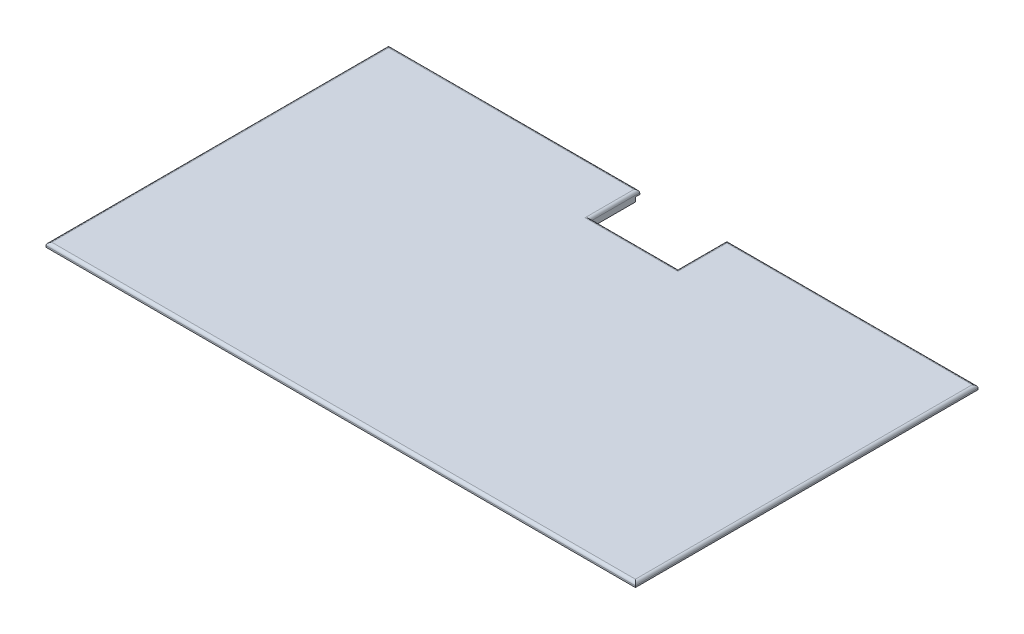
ISO-10303-21;
HEADER;
FILE_DESCRIPTION(('STEP AP214'),'2;1');
FILE_NAME('part.step','',(''),(''),'','','');
FILE_SCHEMA(('AUTOMOTIVE_DESIGN { 1 0 10303 214 1 1 1 1 }'));
ENDSEC;
DATA;
#1=APPLICATION_CONTEXT('core data for automotive mechanical design processes');
#2=APPLICATION_PROTOCOL_DEFINITION('international standard','automotive_design',2000,#1);
#3=PRODUCT_CONTEXT('',#1,'mechanical');
#4=PRODUCT('Part','Part','',(#3));
#5=PRODUCT_RELATED_PRODUCT_CATEGORY('part','',(#4));
#6=PRODUCT_DEFINITION_FORMATION('','',#4);
#7=PRODUCT_DEFINITION_CONTEXT('part definition',#1,'design');
#8=PRODUCT_DEFINITION('design','',#6,#7);
#9=PRODUCT_DEFINITION_SHAPE('','',#8);
#10=(LENGTH_UNIT() NAMED_UNIT(*) SI_UNIT(.MILLI.,.METRE.));
#11=(NAMED_UNIT(*) PLANE_ANGLE_UNIT() SI_UNIT($,.RADIAN.));
#12=(NAMED_UNIT(*) SI_UNIT($,.STERADIAN.) SOLID_ANGLE_UNIT());
#13=UNCERTAINTY_MEASURE_WITH_UNIT(LENGTH_MEASURE(1.E-05),#10,'distance_accuracy_value','');
#14=(GEOMETRIC_REPRESENTATION_CONTEXT(3) GLOBAL_UNCERTAINTY_ASSIGNED_CONTEXT((#13)) GLOBAL_UNIT_ASSIGNED_CONTEXT((#10,
#11,#12)) REPRESENTATION_CONTEXT('',''));
#15=CARTESIAN_POINT('',(0.,0.,0.));
#16=DIRECTION('',(0.,0.,1.));
#17=DIRECTION('',(1.,0.,0.));
#18=AXIS2_PLACEMENT_3D('',#15,#16,#17);
#19=CARTESIAN_POINT('',(-100.,1.5,-57.5));
#20=DIRECTION('',(0.,0.,1.));
#21=DIRECTION('',(1.,0.,0.));
#22=AXIS2_PLACEMENT_3D('',#19,#20,#21);
#23=PLANE('',#22);
#24=DIRECTION('',(-1.,0.,0.));
#25=VECTOR('',#24,1.);
#26=CARTESIAN_POINT('',(-100.,0.,-57.5));
#27=LINE('',#26,#25);
#28=CARTESIAN_POINT('',(100.,0.,-57.5));
#29=VERTEX_POINT('',#28);
#30=CARTESIAN_POINT('',(15.,0.,-57.5));
#31=VERTEX_POINT('',#30);
#32=EDGE_CURVE('E235',#29,#31,#27,.T.);
#33=ORIENTED_EDGE('',*,*,#32,.T.);
#34=DIRECTION('',(0.,1.,0.));
#35=VECTOR('',#34,1.);
#36=CARTESIAN_POINT('',(15.,1.5,-57.5));
#37=LINE('',#36,#35);
#38=CARTESIAN_POINT('',(15.,1.5,-57.5));
#39=VERTEX_POINT('',#38);
#40=EDGE_CURVE('E177',#31,#39,#37,.T.);
#41=ORIENTED_EDGE('',*,*,#40,.T.);
#42=DIRECTION('',(-1.,0.,0.));
#43=VECTOR('',#42,1.);
#44=CARTESIAN_POINT('',(-100.,1.5,-57.5));
#45=LINE('',#44,#43);
#46=CARTESIAN_POINT('',(100.,1.5,-57.5));
#47=VERTEX_POINT('',#46);
#48=EDGE_CURVE('E222',#47,#39,#45,.T.);
#49=ORIENTED_EDGE('',*,*,#48,.F.);
#50=DIRECTION('',(0.,-1.,0.));
#51=VECTOR('',#50,1.);
#52=CARTESIAN_POINT('',(100.,1.5,-57.5));
#53=LINE('',#52,#51);
#54=EDGE_CURVE('E248',#47,#29,#53,.T.);
#55=ORIENTED_EDGE('',*,*,#54,.T.);
#56=EDGE_LOOP('',(#33,#41,#49,#55));
#57=FACE_BOUND('',#56,.T.);
#58=ADVANCED_FACE('F39',(#57),#23,.F.);
#59=CARTESIAN_POINT('',(-101.5,3.,-59.));
#60=DIRECTION('',(0.,0.,1.));
#61=DIRECTION('',(1.,0.,0.));
#62=AXIS2_PLACEMENT_3D('',#59,#60,#61);
#63=PLANE('',#62);
#64=DIRECTION('',(0.,1.,0.));
#65=VECTOR('',#64,1.);
#66=CARTESIAN_POINT('',(15.,3.,-59.));
#67=LINE('',#66,#65);
#68=CARTESIAN_POINT('',(15.,1.5,-59.));
#69=VERTEX_POINT('',#68);
#70=CARTESIAN_POINT('',(15.,2.,-59.));
#71=VERTEX_POINT('',#70);
#72=EDGE_CURVE('E192',#69,#71,#67,.T.);
#73=ORIENTED_EDGE('',*,*,#72,.T.);
#74=DIRECTION('',(-1.,0.,0.));
#75=VECTOR('',#74,1.);
#76=CARTESIAN_POINT('',(-101.5,2.,-59.));
#77=LINE('',#76,#75);
#78=CARTESIAN_POINT('',(101.5,2.,-59.));
#79=VERTEX_POINT('',#78);
#80=EDGE_CURVE('E11',#71,#79,#77,.F.);
#81=ORIENTED_EDGE('',*,*,#80,.T.);
#82=DIRECTION('',(0.,-1.,0.));
#83=VECTOR('',#82,1.);
#84=CARTESIAN_POINT('',(101.5,3.,-59.));
#85=LINE('',#84,#83);
#86=CARTESIAN_POINT('',(101.5,1.5,-59.));
#87=VERTEX_POINT('',#86);
#88=EDGE_CURVE('E214',#79,#87,#85,.T.);
#89=ORIENTED_EDGE('',*,*,#88,.T.);
#90=DIRECTION('',(-1.,0.,0.));
#91=VECTOR('',#90,1.);
#92=CARTESIAN_POINT('',(-101.5,1.5,-59.));
#93=LINE('',#92,#91);
#94=EDGE_CURVE('E199',#87,#69,#93,.T.);
#95=ORIENTED_EDGE('',*,*,#94,.T.);
#96=EDGE_LOOP('',(#73,#81,#89,#95));
#97=FACE_BOUND('',#96,.T.);
#98=ADVANCED_FACE('F355',(#97),#63,.F.);
#99=CARTESIAN_POINT('',(100.,1.5,57.5));
#100=DIRECTION('',(-1.,0.,0.));
#101=DIRECTION('',(0.,0.,1.));
#102=AXIS2_PLACEMENT_3D('',#99,#100,#101);
#103=PLANE('',#102);
#104=DIRECTION('',(0.,0.,-1.));
#105=VECTOR('',#104,1.);
#106=CARTESIAN_POINT('',(100.,0.,57.5));
#107=LINE('',#106,#105);
#108=CARTESIAN_POINT('',(100.,0.,57.5));
#109=VERTEX_POINT('',#108);
#110=EDGE_CURVE('E216',#109,#29,#107,.T.);
#111=ORIENTED_EDGE('',*,*,#110,.T.);
#112=ORIENTED_EDGE('',*,*,#54,.F.);
#113=DIRECTION('',(0.,0.,-1.));
#114=VECTOR('',#113,1.);
#115=CARTESIAN_POINT('',(100.,1.5,57.5));
#116=LINE('',#115,#114);
#117=CARTESIAN_POINT('',(100.,1.5,57.5));
#118=VERTEX_POINT('',#117);
#119=EDGE_CURVE('E217',#118,#47,#116,.T.);
#120=ORIENTED_EDGE('',*,*,#119,.F.);
#121=DIRECTION('',(0.,-1.,0.));
#122=VECTOR('',#121,1.);
#123=CARTESIAN_POINT('',(100.,1.5,57.5));
#124=LINE('',#123,#122);
#125=EDGE_CURVE('E231',#118,#109,#124,.T.);
#126=ORIENTED_EDGE('',*,*,#125,.T.);
#127=EDGE_LOOP('',(#111,#112,#120,#126));
#128=FACE_BOUND('',#127,.T.);
#129=ADVANCED_FACE('F378',(#128),#103,.F.);
#130=CARTESIAN_POINT('',(-15.,1.5,-57.5));
#131=VERTEX_POINT('',#130);
#132=CARTESIAN_POINT('',(-100.,1.5,-57.5));
#133=VERTEX_POINT('',#132);
#134=EDGE_CURVE('E220',#131,#133,#45,.T.);
#135=ORIENTED_EDGE('',*,*,#134,.F.);
#136=DIRECTION('',(0.,-1.,0.));
#137=VECTOR('',#136,1.);
#138=CARTESIAN_POINT('',(-15.,1.5,-57.5));
#139=LINE('',#138,#137);
#140=CARTESIAN_POINT('',(-15.,0.,-57.5));
#141=VERTEX_POINT('',#140);
#142=EDGE_CURVE('E189',#131,#141,#139,.T.);
#143=ORIENTED_EDGE('',*,*,#142,.T.);
#144=CARTESIAN_POINT('',(-100.,0.,-57.5));
#145=VERTEX_POINT('',#144);
#146=EDGE_CURVE('E234',#141,#145,#27,.T.);
#147=ORIENTED_EDGE('',*,*,#146,.T.);
#148=DIRECTION('',(0.,-1.,0.));
#149=VECTOR('',#148,1.);
#150=CARTESIAN_POINT('',(-100.,1.5,-57.5));
#151=LINE('',#150,#149);
#152=EDGE_CURVE('E245',#133,#145,#151,.T.);
#153=ORIENTED_EDGE('',*,*,#152,.F.);
#154=EDGE_LOOP('',(#135,#143,#147,#153));
#155=FACE_BOUND('',#154,.T.);
#156=ADVANCED_FACE('F374',(#155),#23,.F.);
#157=CARTESIAN_POINT('',(-100.,1.5,57.5));
#158=DIRECTION('',(1.,0.,0.));
#159=DIRECTION('',(0.,0.,-1.));
#160=AXIS2_PLACEMENT_3D('',#157,#158,#159);
#161=PLANE('',#160);
#162=DIRECTION('',(0.,0.,1.));
#163=VECTOR('',#162,1.);
#164=CARTESIAN_POINT('',(-100.,0.,57.5));
#165=LINE('',#164,#163);
#166=CARTESIAN_POINT('',(-100.,0.,57.5));
#167=VERTEX_POINT('',#166);
#168=EDGE_CURVE('E237',#145,#167,#165,.T.);
#169=ORIENTED_EDGE('',*,*,#168,.T.);
#170=DIRECTION('',(0.,-1.,0.));
#171=VECTOR('',#170,1.);
#172=CARTESIAN_POINT('',(-100.,1.5,57.5));
#173=LINE('',#172,#171);
#174=CARTESIAN_POINT('',(-100.,1.5,57.5));
#175=VERTEX_POINT('',#174);
#176=EDGE_CURVE('E242',#175,#167,#173,.T.);
#177=ORIENTED_EDGE('',*,*,#176,.F.);
#178=DIRECTION('',(0.,0.,1.));
#179=VECTOR('',#178,1.);
#180=CARTESIAN_POINT('',(-100.,1.5,57.5));
#181=LINE('',#180,#179);
#182=EDGE_CURVE('E225',#133,#175,#181,.T.);
#183=ORIENTED_EDGE('',*,*,#182,.F.);
#184=ORIENTED_EDGE('',*,*,#152,.T.);
#185=EDGE_LOOP('',(#169,#177,#183,#184));
#186=FACE_BOUND('',#185,.T.);
#187=ADVANCED_FACE('F382',(#186),#161,.F.);
#188=CARTESIAN_POINT('',(-100.,1.5,57.5));
#189=DIRECTION('',(0.,0.,-1.));
#190=DIRECTION('',(-1.,0.,0.));
#191=AXIS2_PLACEMENT_3D('',#188,#189,#190);
#192=PLANE('',#191);
#193=DIRECTION('',(1.,0.,0.));
#194=VECTOR('',#193,1.);
#195=CARTESIAN_POINT('',(-100.,0.,57.5));
#196=LINE('',#195,#194);
#197=EDGE_CURVE('E221',#167,#109,#196,.T.);
#198=ORIENTED_EDGE('',*,*,#197,.T.);
#199=ORIENTED_EDGE('',*,*,#125,.F.);
#200=DIRECTION('',(1.,0.,0.));
#201=VECTOR('',#200,1.);
#202=CARTESIAN_POINT('',(-100.,1.5,57.5));
#203=LINE('',#202,#201);
#204=EDGE_CURVE('E228',#175,#118,#203,.T.);
#205=ORIENTED_EDGE('',*,*,#204,.F.);
#206=ORIENTED_EDGE('',*,*,#176,.T.);
#207=EDGE_LOOP('',(#198,#199,#205,#206));
#208=FACE_BOUND('',#207,.T.);
#209=ADVANCED_FACE('F388',(#208),#192,.F.);
#210=CARTESIAN_POINT('',(0.,0.,0.));
#211=DIRECTION('',(0.,-1.,0.));
#212=DIRECTION('',(0.,0.,-1.));
#213=AXIS2_PLACEMENT_3D('',#210,#211,#212);
#214=PLANE('',#213);
#215=DIRECTION('',(0.,0.,1.));
#216=VECTOR('',#215,1.);
#217=CARTESIAN_POINT('',(15.,0.,-42.1479889198574));
#218=LINE('',#217,#216);
#219=CARTESIAN_POINT('',(15.,0.,-42.1479889198574));
#220=VERTEX_POINT('',#219);
#221=EDGE_CURVE('E174',#31,#220,#218,.T.);
#222=ORIENTED_EDGE('',*,*,#221,.F.);
#223=ORIENTED_EDGE('',*,*,#32,.F.);
#224=ORIENTED_EDGE('',*,*,#110,.F.);
#225=ORIENTED_EDGE('',*,*,#197,.F.);
#226=ORIENTED_EDGE('',*,*,#168,.F.);
#227=ORIENTED_EDGE('',*,*,#146,.F.);
#228=DIRECTION('',(0.,0.,-1.));
#229=VECTOR('',#228,1.);
#230=CARTESIAN_POINT('',(-15.,0.,-42.1479889198574));
#231=LINE('',#230,#229);
#232=CARTESIAN_POINT('',(-15.,0.,-42.1479889198574));
#233=VERTEX_POINT('',#232);
#234=EDGE_CURVE('E171',#233,#141,#231,.T.);
#235=ORIENTED_EDGE('',*,*,#234,.F.);
#236=DIRECTION('',(-1.,0.,0.));
#237=VECTOR('',#236,1.);
#238=CARTESIAN_POINT('',(-15.,0.,-42.1479889198574));
#239=LINE('',#238,#237);
#240=EDGE_CURVE('E167',#220,#233,#239,.T.);
#241=ORIENTED_EDGE('',*,*,#240,.F.);
#242=EDGE_LOOP('',(#222,#223,#224,#225,#226,#227,#235,#241));
#243=FACE_BOUND('',#242,.T.);
#244=ADVANCED_FACE('F181',(#243),#214,.T.);
#245=CARTESIAN_POINT('',(101.5,3.,59.));
#246=DIRECTION('',(-1.,0.,0.));
#247=DIRECTION('',(0.,0.,1.));
#248=AXIS2_PLACEMENT_3D('',#245,#246,#247);
#249=PLANE('',#248);
#250=ORIENTED_EDGE('',*,*,#88,.F.);
#251=DIRECTION('',(0.,0.,-1.));
#252=VECTOR('',#251,1.);
#253=CARTESIAN_POINT('',(101.5,2.,59.));
#254=LINE('',#253,#252);
#255=CARTESIAN_POINT('',(101.5,2.,59.));
#256=VERTEX_POINT('',#255);
#257=EDGE_CURVE('E273',#79,#256,#254,.F.);
#258=ORIENTED_EDGE('',*,*,#257,.T.);
#259=DIRECTION('',(0.,-1.,0.));
#260=VECTOR('',#259,1.);
#261=CARTESIAN_POINT('',(101.5,3.,59.));
#262=LINE('',#261,#260);
#263=CARTESIAN_POINT('',(101.5,1.5,59.));
#264=VERTEX_POINT('',#263);
#265=EDGE_CURVE('E208',#256,#264,#262,.T.);
#266=ORIENTED_EDGE('',*,*,#265,.T.);
#267=DIRECTION('',(0.,0.,-1.));
#268=VECTOR('',#267,1.);
#269=CARTESIAN_POINT('',(101.5,1.5,59.));
#270=LINE('',#269,#268);
#271=EDGE_CURVE('E195',#264,#87,#270,.T.);
#272=ORIENTED_EDGE('',*,*,#271,.T.);
#273=EDGE_LOOP('',(#250,#258,#266,#272));
#274=FACE_BOUND('',#273,.T.);
#275=ADVANCED_FACE('F359',(#274),#249,.F.);
#276=DIRECTION('',(0.,-1.,0.));
#277=VECTOR('',#276,1.);
#278=CARTESIAN_POINT('',(-101.5,3.,-59.));
#279=LINE('',#278,#277);
#280=CARTESIAN_POINT('',(-101.5,2.,-59.));
#281=VERTEX_POINT('',#280);
#282=CARTESIAN_POINT('',(-101.5,1.5,-59.));
#283=VERTEX_POINT('',#282);
#284=EDGE_CURVE('E212',#281,#283,#279,.T.);
#285=ORIENTED_EDGE('',*,*,#284,.F.);
#286=DIRECTION('',(-1.,0.,0.));
#287=VECTOR('',#286,1.);
#288=CARTESIAN_POINT('',(-101.5,2.,-59.));
#289=LINE('',#288,#287);
#290=CARTESIAN_POINT('',(-15.,2.,-59.));
#291=VERTEX_POINT('',#290);
#292=EDGE_CURVE('E280',#281,#291,#289,.F.);
#293=ORIENTED_EDGE('',*,*,#292,.T.);
#294=DIRECTION('',(0.,-1.,0.));
#295=VECTOR('',#294,1.);
#296=CARTESIAN_POINT('',(-15.,3.,-59.));
#297=LINE('',#296,#295);
#298=CARTESIAN_POINT('',(-15.,1.5,-59.));
#299=VERTEX_POINT('',#298);
#300=EDGE_CURVE('E186',#291,#299,#297,.T.);
#301=ORIENTED_EDGE('',*,*,#300,.T.);
#302=EDGE_CURVE('E198',#299,#283,#93,.T.);
#303=ORIENTED_EDGE('',*,*,#302,.T.);
#304=EDGE_LOOP('',(#285,#293,#301,#303));
#305=FACE_BOUND('',#304,.T.);
#306=ADVANCED_FACE('F324',(#305),#63,.F.);
#307=CARTESIAN_POINT('',(-101.5,3.,59.));
#308=DIRECTION('',(1.,0.,0.));
#309=DIRECTION('',(0.,0.,-1.));
#310=AXIS2_PLACEMENT_3D('',#307,#308,#309);
#311=PLANE('',#310);
#312=DIRECTION('',(0.,-1.,0.));
#313=VECTOR('',#312,1.);
#314=CARTESIAN_POINT('',(-101.5,3.,59.));
#315=LINE('',#314,#313);
#316=CARTESIAN_POINT('',(-101.5,2.,59.));
#317=VERTEX_POINT('',#316);
#318=CARTESIAN_POINT('',(-101.5,1.5,59.));
#319=VERTEX_POINT('',#318);
#320=EDGE_CURVE('E210',#317,#319,#315,.T.);
#321=ORIENTED_EDGE('',*,*,#320,.F.);
#322=DIRECTION('',(0.,0.,1.));
#323=VECTOR('',#322,1.);
#324=CARTESIAN_POINT('',(-101.5,2.,59.));
#325=LINE('',#324,#323);
#326=EDGE_CURVE('E278',#317,#281,#325,.F.);
#327=ORIENTED_EDGE('',*,*,#326,.T.);
#328=ORIENTED_EDGE('',*,*,#284,.T.);
#329=DIRECTION('',(0.,0.,1.));
#330=VECTOR('',#329,1.);
#331=CARTESIAN_POINT('',(-101.5,1.5,59.));
#332=LINE('',#331,#330);
#333=EDGE_CURVE('E202',#283,#319,#332,.T.);
#334=ORIENTED_EDGE('',*,*,#333,.T.);
#335=EDGE_LOOP('',(#321,#327,#328,#334));
#336=FACE_BOUND('',#335,.T.);
#337=ADVANCED_FACE('F328',(#336),#311,.F.);
#338=CARTESIAN_POINT('',(-101.5,3.,59.));
#339=DIRECTION('',(0.,0.,-1.));
#340=DIRECTION('',(-1.,0.,0.));
#341=AXIS2_PLACEMENT_3D('',#338,#339,#340);
#342=PLANE('',#341);
#343=ORIENTED_EDGE('',*,*,#265,.F.);
#344=DIRECTION('',(1.,0.,0.));
#345=VECTOR('',#344,1.);
#346=CARTESIAN_POINT('',(-101.5,2.,59.));
#347=LINE('',#346,#345);
#348=EDGE_CURVE('E276',#256,#317,#347,.F.);
#349=ORIENTED_EDGE('',*,*,#348,.T.);
#350=ORIENTED_EDGE('',*,*,#320,.T.);
#351=DIRECTION('',(1.,0.,0.));
#352=VECTOR('',#351,1.);
#353=CARTESIAN_POINT('',(-101.5,1.5,59.));
#354=LINE('',#353,#352);
#355=EDGE_CURVE('E205',#319,#264,#354,.T.);
#356=ORIENTED_EDGE('',*,*,#355,.T.);
#357=EDGE_LOOP('',(#343,#349,#350,#356));
#358=FACE_BOUND('',#357,.T.);
#359=ADVANCED_FACE('F398',(#358),#342,.F.);
#360=CARTESIAN_POINT('',(0.,3.,0.));
#361=DIRECTION('',(0.,-1.,0.));
#362=DIRECTION('',(0.,0.,-1.));
#363=AXIS2_PLACEMENT_3D('',#360,#361,#362);
#364=PLANE('',#363);
#365=DIRECTION('',(1.,0.,0.));
#366=VECTOR('',#365,1.);
#367=CARTESIAN_POINT('',(0.,3.,58.));
#368=LINE('',#367,#366);
#369=CARTESIAN_POINT('',(-100.5,3.,58.));
#370=VERTEX_POINT('',#369);
#371=CARTESIAN_POINT('',(100.5,3.,58.));
#372=VERTEX_POINT('',#371);
#373=EDGE_CURVE('E268',#370,#372,#368,.T.);
#374=ORIENTED_EDGE('',*,*,#373,.T.);
#375=DIRECTION('',(0.,0.,-1.));
#376=VECTOR('',#375,1.);
#377=CARTESIAN_POINT('',(100.5,3.,0.));
#378=LINE('',#377,#376);
#379=CARTESIAN_POINT('',(100.5,3.,-58.));
#380=VERTEX_POINT('',#379);
#381=EDGE_CURVE('E270',#372,#380,#378,.T.);
#382=ORIENTED_EDGE('',*,*,#381,.T.);
#383=DIRECTION('',(-1.,0.,0.));
#384=VECTOR('',#383,1.);
#385=CARTESIAN_POINT('',(0.,3.,-58.));
#386=LINE('',#385,#384);
#387=CARTESIAN_POINT('',(16.,3.,-58.));
#388=VERTEX_POINT('',#387);
#389=EDGE_CURVE('E256',#380,#388,#386,.T.);
#390=ORIENTED_EDGE('',*,*,#389,.T.);
#391=DIRECTION('',(0.,0.,1.));
#392=VECTOR('',#391,1.);
#393=CARTESIAN_POINT('',(16.,3.,0.));
#394=LINE('',#393,#392);
#395=CARTESIAN_POINT('',(16.,3.,-41.1479889198574));
#396=VERTEX_POINT('',#395);
#397=EDGE_CURVE('E258',#388,#396,#394,.T.);
#398=ORIENTED_EDGE('',*,*,#397,.T.);
#399=DIRECTION('',(-1.,0.,0.));
#400=VECTOR('',#399,1.);
#401=CARTESIAN_POINT('',(0.,3.,-41.1479889198574));
#402=LINE('',#401,#400);
#403=CARTESIAN_POINT('',(-16.,3.,-41.1479889198574));
#404=VERTEX_POINT('',#403);
#405=EDGE_CURVE('E260',#396,#404,#402,.T.);
#406=ORIENTED_EDGE('',*,*,#405,.T.);
#407=DIRECTION('',(0.,0.,-1.));
#408=VECTOR('',#407,1.);
#409=CARTESIAN_POINT('',(-16.,3.,0.));
#410=LINE('',#409,#408);
#411=CARTESIAN_POINT('',(-16.,3.,-58.));
#412=VERTEX_POINT('',#411);
#413=EDGE_CURVE('E262',#404,#412,#410,.T.);
#414=ORIENTED_EDGE('',*,*,#413,.T.);
#415=DIRECTION('',(-1.,0.,0.));
#416=VECTOR('',#415,1.);
#417=CARTESIAN_POINT('',(0.,3.,-58.));
#418=LINE('',#417,#416);
#419=CARTESIAN_POINT('',(-100.5,3.,-58.));
#420=VERTEX_POINT('',#419);
#421=EDGE_CURVE('E264',#412,#420,#418,.T.);
#422=ORIENTED_EDGE('',*,*,#421,.T.);
#423=DIRECTION('',(0.,0.,1.));
#424=VECTOR('',#423,1.);
#425=CARTESIAN_POINT('',(-100.5,3.,0.));
#426=LINE('',#425,#424);
#427=EDGE_CURVE('E266',#420,#370,#426,.T.);
#428=ORIENTED_EDGE('',*,*,#427,.T.);
#429=EDGE_LOOP('',(#374,#382,#390,#398,#406,#414,#422,#428));
#430=FACE_BOUND('',#429,.T.);
#431=ADVANCED_FACE('F342',(#430),#364,.F.);
#432=CARTESIAN_POINT('',(0.,1.5,0.));
#433=DIRECTION('',(0.,-1.,0.));
#434=DIRECTION('',(0.,0.,-1.));
#435=AXIS2_PLACEMENT_3D('',#432,#433,#434);
#436=PLANE('',#435);
#437=DIRECTION('',(0.,0.,1.));
#438=VECTOR('',#437,1.);
#439=CARTESIAN_POINT('',(15.,1.5,0.));
#440=LINE('',#439,#438);
#441=EDGE_CURVE('E254',#69,#39,#440,.T.);
#442=ORIENTED_EDGE('',*,*,#441,.F.);
#443=ORIENTED_EDGE('',*,*,#94,.F.);
#444=ORIENTED_EDGE('',*,*,#271,.F.);
#445=ORIENTED_EDGE('',*,*,#355,.F.);
#446=ORIENTED_EDGE('',*,*,#333,.F.);
#447=ORIENTED_EDGE('',*,*,#302,.F.);
#448=DIRECTION('',(0.,0.,-1.));
#449=VECTOR('',#448,1.);
#450=CARTESIAN_POINT('',(-15.,1.5,0.));
#451=LINE('',#450,#449);
#452=EDGE_CURVE('E251',#131,#299,#451,.T.);
#453=ORIENTED_EDGE('',*,*,#452,.F.);
#454=ORIENTED_EDGE('',*,*,#134,.T.);
#455=ORIENTED_EDGE('',*,*,#182,.T.);
#456=ORIENTED_EDGE('',*,*,#204,.T.);
#457=ORIENTED_EDGE('',*,*,#119,.T.);
#458=ORIENTED_EDGE('',*,*,#48,.T.);
#459=EDGE_LOOP('',(#442,#443,#444,#445,#446,#447,#453,#454,#455,#456,#457,#458));
#460=FACE_BOUND('',#459,.T.);
#461=ADVANCED_FACE('F396',(#460),#436,.T.);
#462=CARTESIAN_POINT('',(-15.,11.5,-42.1479889198574));
#463=DIRECTION('',(0.,0.,1.));
#464=DIRECTION('',(1.,0.,0.));
#465=AXIS2_PLACEMENT_3D('',#462,#463,#464);
#466=PLANE('',#465);
#467=DIRECTION('',(0.,-1.,0.));
#468=VECTOR('',#467,1.);
#469=CARTESIAN_POINT('',(-15.,11.5,-42.1479889198574));
#470=LINE('',#469,#468);
#471=CARTESIAN_POINT('',(-15.,2.,-42.1479889198574));
#472=VERTEX_POINT('',#471);
#473=EDGE_CURVE('E170',#472,#233,#470,.T.);
#474=ORIENTED_EDGE('',*,*,#473,.F.);
#475=DIRECTION('',(-1.,0.,0.));
#476=VECTOR('',#475,1.);
#477=CARTESIAN_POINT('',(-15.,2.,-42.1479889198574));
#478=LINE('',#477,#476);
#479=CARTESIAN_POINT('',(15.,2.,-42.1479889198574));
#480=VERTEX_POINT('',#479);
#481=EDGE_CURVE('E63',#472,#480,#478,.F.);
#482=ORIENTED_EDGE('',*,*,#481,.T.);
#483=DIRECTION('',(0.,-1.,0.));
#484=VECTOR('',#483,1.);
#485=CARTESIAN_POINT('',(15.,11.5,-42.1479889198574));
#486=LINE('',#485,#484);
#487=EDGE_CURVE('E163',#480,#220,#486,.T.);
#488=ORIENTED_EDGE('',*,*,#487,.T.);
#489=ORIENTED_EDGE('',*,*,#240,.T.);
#490=EDGE_LOOP('',(#474,#482,#488,#489));
#491=FACE_BOUND('',#490,.T.);
#492=ADVANCED_FACE('F165',(#491),#466,.F.);
#493=CARTESIAN_POINT('',(15.,11.5,-42.1479889198574));
#494=DIRECTION('',(1.,0.,0.));
#495=DIRECTION('',(0.,0.,-1.));
#496=AXIS2_PLACEMENT_3D('',#493,#494,#495);
#497=PLANE('',#496);
#498=ORIENTED_EDGE('',*,*,#487,.F.);
#499=DIRECTION('',(0.,0.,1.));
#500=VECTOR('',#499,1.);
#501=CARTESIAN_POINT('',(15.,2.,-42.1479889198574));
#502=LINE('',#501,#500);
#503=EDGE_CURVE('E48',#480,#71,#502,.F.);
#504=ORIENTED_EDGE('',*,*,#503,.T.);
#505=ORIENTED_EDGE('',*,*,#72,.F.);
#506=ORIENTED_EDGE('',*,*,#441,.T.);
#507=ORIENTED_EDGE('',*,*,#40,.F.);
#508=ORIENTED_EDGE('',*,*,#221,.T.);
#509=EDGE_LOOP('',(#498,#504,#505,#506,#507,#508));
#510=FACE_BOUND('',#509,.T.);
#511=ADVANCED_FACE('F175',(#510),#497,.F.);
#512=CARTESIAN_POINT('',(-15.,11.5,-42.1479889198574));
#513=DIRECTION('',(-1.,0.,0.));
#514=DIRECTION('',(0.,0.,1.));
#515=AXIS2_PLACEMENT_3D('',#512,#513,#514);
#516=PLANE('',#515);
#517=ORIENTED_EDGE('',*,*,#300,.F.);
#518=DIRECTION('',(0.,0.,-1.));
#519=VECTOR('',#518,1.);
#520=CARTESIAN_POINT('',(-15.,2.,-42.1479889198574));
#521=LINE('',#520,#519);
#522=EDGE_CURVE('E282',#291,#472,#521,.F.);
#523=ORIENTED_EDGE('',*,*,#522,.T.);
#524=ORIENTED_EDGE('',*,*,#473,.T.);
#525=ORIENTED_EDGE('',*,*,#234,.T.);
#526=ORIENTED_EDGE('',*,*,#142,.F.);
#527=ORIENTED_EDGE('',*,*,#452,.T.);
#528=EDGE_LOOP('',(#517,#523,#524,#525,#526,#527));
#529=FACE_BOUND('',#528,.T.);
#530=ADVANCED_FACE('F318',(#529),#516,.F.);
#531=CARTESIAN_POINT('',(-16.,2.,0.));
#532=DIRECTION('',(0.,0.,-1.));
#533=DIRECTION('',(-1.,0.,0.));
#534=AXIS2_PLACEMENT_3D('',#531,#532,#533);
#535=CYLINDRICAL_SURFACE('',#534,1.);
#536=CARTESIAN_POINT('',(-16.,2.,-41.1479889198574));
#537=DIRECTION('',(-0.707106781186547,0.,-0.707106781186548));
#538=DIRECTION('',(0.707106781186548,0.,-0.707106781186547));
#539=AXIS2_PLACEMENT_3D('',#536,#537,#538);
#540=ELLIPSE('',#539,1.41421356237309,1.);
#541=EDGE_CURVE('E301',#472,#404,#540,.F.);
#542=ORIENTED_EDGE('',*,*,#541,.F.);
#543=ORIENTED_EDGE('',*,*,#522,.F.);
#544=CARTESIAN_POINT('',(-16.,2.,-58.));
#545=DIRECTION('',(-0.707106781186547,0.,-0.707106781186547));
#546=DIRECTION('',(0.707106781186547,0.,-0.707106781186547));
#547=AXIS2_PLACEMENT_3D('',#544,#545,#546);
#548=ELLIPSE('',#547,1.41421356237309,1.);
#549=EDGE_CURVE('E43',#412,#291,#548,.T.);
#550=ORIENTED_EDGE('',*,*,#549,.F.);
#551=ORIENTED_EDGE('',*,*,#413,.F.);
#552=EDGE_LOOP('',(#542,#543,#550,#551));
#553=FACE_BOUND('',#552,.T.);
#554=ADVANCED_FACE('F41',(#553),#535,.T.);
#555=CARTESIAN_POINT('',(0.,2.,-58.));
#556=DIRECTION('',(-1.,0.,0.));
#557=DIRECTION('',(0.,0.,1.));
#558=AXIS2_PLACEMENT_3D('',#555,#556,#557);
#559=CYLINDRICAL_SURFACE('',#558,1.);
#560=ORIENTED_EDGE('',*,*,#549,.T.);
#561=ORIENTED_EDGE('',*,*,#292,.F.);
#562=CARTESIAN_POINT('',(-100.5,2.,-58.));
#563=DIRECTION('',(-0.707106781186547,0.,0.707106781186547));
#564=DIRECTION('',(-0.707106781186547,0.,-0.707106781186547));
#565=AXIS2_PLACEMENT_3D('',#562,#563,#564);
#566=ELLIPSE('',#565,1.41421356237309,1.);
#567=EDGE_CURVE('E299',#420,#281,#566,.T.);
#568=ORIENTED_EDGE('',*,*,#567,.F.);
#569=ORIENTED_EDGE('',*,*,#421,.F.);
#570=EDGE_LOOP('',(#560,#561,#568,#569));
#571=FACE_BOUND('',#570,.T.);
#572=ADVANCED_FACE('F311',(#571),#559,.T.);
#573=CARTESIAN_POINT('',(0.,2.,-41.1479889198574));
#574=DIRECTION('',(-1.,0.,0.));
#575=DIRECTION('',(0.,0.,1.));
#576=AXIS2_PLACEMENT_3D('',#573,#574,#575);
#577=CYLINDRICAL_SURFACE('',#576,1.);
#578=ORIENTED_EDGE('',*,*,#541,.T.);
#579=ORIENTED_EDGE('',*,*,#405,.F.);
#580=CARTESIAN_POINT('',(16.,2.,-41.1479889198574));
#581=DIRECTION('',(-0.707106781186548,0.,0.707106781186547));
#582=DIRECTION('',(-0.707106781186547,0.,-0.707106781186548));
#583=AXIS2_PLACEMENT_3D('',#580,#581,#582);
#584=ELLIPSE('',#583,1.41421356237309,1.);
#585=EDGE_CURVE('E296',#480,#396,#584,.F.);
#586=ORIENTED_EDGE('',*,*,#585,.F.);
#587=ORIENTED_EDGE('',*,*,#481,.F.);
#588=EDGE_LOOP('',(#578,#579,#586,#587));
#589=FACE_BOUND('',#588,.T.);
#590=ADVANCED_FACE('F344',(#589),#577,.T.);
#591=CARTESIAN_POINT('',(-100.5,2.,0.));
#592=DIRECTION('',(0.,0.,1.));
#593=DIRECTION('',(1.,0.,0.));
#594=AXIS2_PLACEMENT_3D('',#591,#592,#593);
#595=CYLINDRICAL_SURFACE('',#594,1.);
#596=ORIENTED_EDGE('',*,*,#567,.T.);
#597=ORIENTED_EDGE('',*,*,#326,.F.);
#598=CARTESIAN_POINT('',(-100.5,2.,58.));
#599=DIRECTION('',(0.707106781186547,0.,0.707106781186547));
#600=DIRECTION('',(-0.707106781186547,0.,0.707106781186547));
#601=AXIS2_PLACEMENT_3D('',#598,#599,#600);
#602=ELLIPSE('',#601,1.41421356237309,1.);
#603=EDGE_CURVE('E293',#370,#317,#602,.T.);
#604=ORIENTED_EDGE('',*,*,#603,.F.);
#605=ORIENTED_EDGE('',*,*,#427,.F.);
#606=EDGE_LOOP('',(#596,#597,#604,#605));
#607=FACE_BOUND('',#606,.T.);
#608=ADVANCED_FACE('F333',(#607),#595,.T.);
#609=CARTESIAN_POINT('',(16.,2.,0.));
#610=DIRECTION('',(0.,0.,1.));
#611=DIRECTION('',(1.,0.,0.));
#612=AXIS2_PLACEMENT_3D('',#609,#610,#611);
#613=CYLINDRICAL_SURFACE('',#612,1.);
#614=ORIENTED_EDGE('',*,*,#585,.T.);
#615=ORIENTED_EDGE('',*,*,#397,.F.);
#616=CARTESIAN_POINT('',(16.,2.,-58.));
#617=DIRECTION('',(-0.707106781186548,0.,0.707106781186547));
#618=DIRECTION('',(-0.707106781186547,0.,-0.707106781186548));
#619=AXIS2_PLACEMENT_3D('',#616,#617,#618);
#620=ELLIPSE('',#619,1.41421356237309,1.);
#621=EDGE_CURVE('E290',#71,#388,#620,.F.);
#622=ORIENTED_EDGE('',*,*,#621,.F.);
#623=ORIENTED_EDGE('',*,*,#503,.F.);
#624=EDGE_LOOP('',(#614,#615,#622,#623));
#625=FACE_BOUND('',#624,.T.);
#626=ADVANCED_FACE('F346',(#625),#613,.T.);
#627=CARTESIAN_POINT('',(0.,2.,58.));
#628=DIRECTION('',(1.,0.,0.));
#629=DIRECTION('',(0.,0.,-1.));
#630=AXIS2_PLACEMENT_3D('',#627,#628,#629);
#631=CYLINDRICAL_SURFACE('',#630,1.);
#632=ORIENTED_EDGE('',*,*,#603,.T.);
#633=ORIENTED_EDGE('',*,*,#348,.F.);
#634=CARTESIAN_POINT('',(100.5,2.,58.));
#635=DIRECTION('',(0.707106781186547,0.,-0.707106781186547));
#636=DIRECTION('',(0.707106781186547,0.,0.707106781186547));
#637=AXIS2_PLACEMENT_3D('',#634,#635,#636);
#638=ELLIPSE('',#637,1.41421356237309,1.);
#639=EDGE_CURVE('E288',#372,#256,#638,.T.);
#640=ORIENTED_EDGE('',*,*,#639,.F.);
#641=ORIENTED_EDGE('',*,*,#373,.F.);
#642=EDGE_LOOP('',(#632,#633,#640,#641));
#643=FACE_BOUND('',#642,.T.);
#644=ADVANCED_FACE('F338',(#643),#631,.T.);
#645=CARTESIAN_POINT('',(0.,2.,-58.));
#646=DIRECTION('',(-1.,0.,0.));
#647=DIRECTION('',(0.,0.,1.));
#648=AXIS2_PLACEMENT_3D('',#645,#646,#647);
#649=CYLINDRICAL_SURFACE('',#648,1.);
#650=ORIENTED_EDGE('',*,*,#621,.T.);
#651=ORIENTED_EDGE('',*,*,#389,.F.);
#652=CARTESIAN_POINT('',(100.5,2.,-58.));
#653=DIRECTION('',(-0.707106781186547,0.,-0.707106781186547));
#654=DIRECTION('',(-0.707106781186547,0.,0.707106781186547));
#655=AXIS2_PLACEMENT_3D('',#652,#653,#654);
#656=ELLIPSE('',#655,1.41421356237309,1.);
#657=EDGE_CURVE('E286',#79,#380,#656,.F.);
#658=ORIENTED_EDGE('',*,*,#657,.F.);
#659=ORIENTED_EDGE('',*,*,#80,.F.);
#660=EDGE_LOOP('',(#650,#651,#658,#659));
#661=FACE_BOUND('',#660,.T.);
#662=ADVANCED_FACE('F352',(#661),#649,.T.);
#663=CARTESIAN_POINT('',(100.5,2.,0.));
#664=DIRECTION('',(0.,0.,-1.));
#665=DIRECTION('',(-1.,0.,0.));
#666=AXIS2_PLACEMENT_3D('',#663,#664,#665);
#667=CYLINDRICAL_SURFACE('',#666,1.);
#668=ORIENTED_EDGE('',*,*,#639,.T.);
#669=ORIENTED_EDGE('',*,*,#257,.F.);
#670=ORIENTED_EDGE('',*,*,#657,.T.);
#671=ORIENTED_EDGE('',*,*,#381,.F.);
#672=EDGE_LOOP('',(#668,#669,#670,#671));
#673=FACE_BOUND('',#672,.T.);
#674=ADVANCED_FACE('F363',(#673),#667,.T.);
#675=CLOSED_SHELL('',(#58,#98,#129,#156,#187,#209,#244,#275,#306,#337,#359,#431,#461,#492,#511,
#530,#554,#572,#590,#608,#626,#644,#662,#674));
#676=MANIFOLD_SOLID_BREP('B2',#675);
#677=ADVANCED_BREP_SHAPE_REPRESENTATION('',(#18,#676),#14);
#678=SHAPE_DEFINITION_REPRESENTATION(#9,#677);
ENDSEC;
END-ISO-10303-21;
